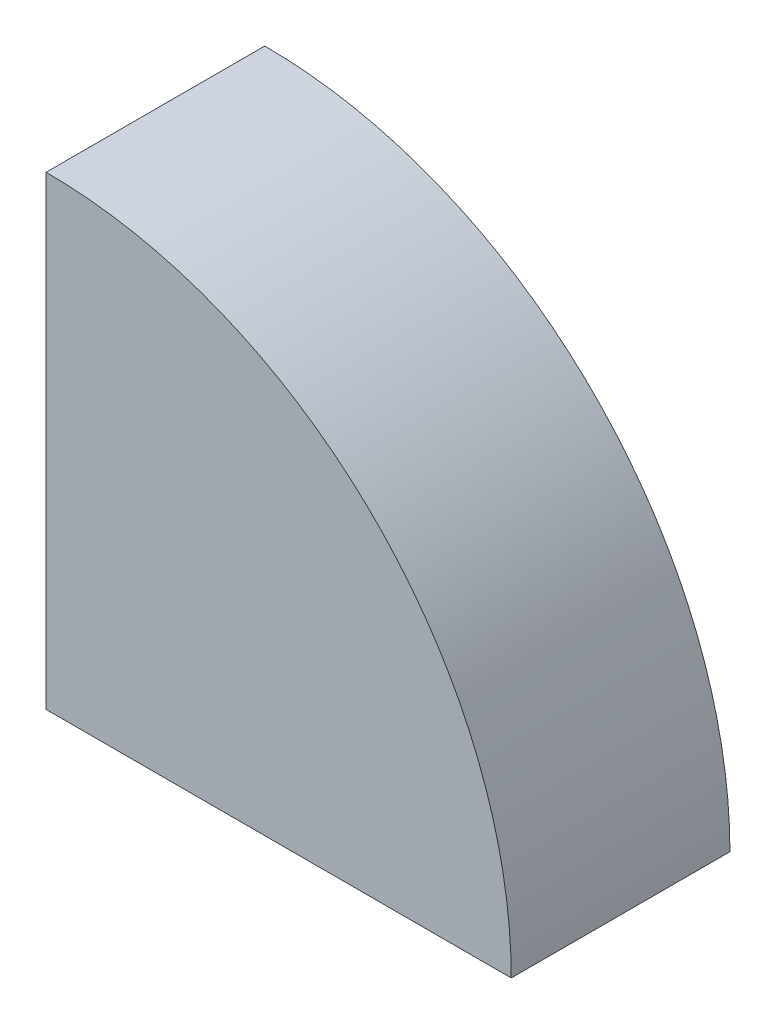
ISO-10303-21;
HEADER;
FILE_DESCRIPTION(('STEP AP214'),'2;1');
FILE_NAME('part.step','',(''),(''),'','','');
FILE_SCHEMA(('AUTOMOTIVE_DESIGN { 1 0 10303 214 1 1 1 1 }'));
ENDSEC;
DATA;
#1=APPLICATION_CONTEXT('core data for automotive mechanical design processes');
#2=APPLICATION_PROTOCOL_DEFINITION('international standard','automotive_design',2000,#1);
#3=PRODUCT_CONTEXT('',#1,'mechanical');
#4=PRODUCT('Part','Part','',(#3));
#5=PRODUCT_RELATED_PRODUCT_CATEGORY('part','',(#4));
#6=PRODUCT_DEFINITION_FORMATION('','',#4);
#7=PRODUCT_DEFINITION_CONTEXT('part definition',#1,'design');
#8=PRODUCT_DEFINITION('design','',#6,#7);
#9=PRODUCT_DEFINITION_SHAPE('','',#8);
#10=(LENGTH_UNIT() NAMED_UNIT(*) SI_UNIT(.MILLI.,.METRE.));
#11=(NAMED_UNIT(*) PLANE_ANGLE_UNIT() SI_UNIT($,.RADIAN.));
#12=(NAMED_UNIT(*) SI_UNIT($,.STERADIAN.) SOLID_ANGLE_UNIT());
#13=UNCERTAINTY_MEASURE_WITH_UNIT(LENGTH_MEASURE(1.E-05),#10,'distance_accuracy_value','');
#14=(GEOMETRIC_REPRESENTATION_CONTEXT(3) GLOBAL_UNCERTAINTY_ASSIGNED_CONTEXT((#13)) GLOBAL_UNIT_ASSIGNED_CONTEXT((#10,
#11,#12)) REPRESENTATION_CONTEXT('',''));
#15=CARTESIAN_POINT('',(0.,0.,0.));
#16=DIRECTION('',(0.,0.,1.));
#17=DIRECTION('',(1.,0.,0.));
#18=AXIS2_PLACEMENT_3D('',#15,#16,#17);
#19=CARTESIAN_POINT('',(2.,2.,164.030588258053));
#20=DIRECTION('',(0.,0.,-1.));
#21=DIRECTION('',(-1.,0.,0.));
#22=AXIS2_PLACEMENT_3D('',#19,#20,#21);
#23=CYLINDRICAL_SURFACE('',#22,85.);
#24=DIRECTION('',(0.,0.,-1.));
#25=VECTOR('',#24,1.);
#26=CARTESIAN_POINT('',(2.,87.,164.030588258053));
#27=LINE('',#26,#25);
#28=CARTESIAN_POINT('',(1.99999999999994,87.,33.));
#29=VERTEX_POINT('',#28);
#30=CARTESIAN_POINT('',(1.99999999999994,87.,9.4));
#31=VERTEX_POINT('',#30);
#32=EDGE_CURVE('E406',#29,#31,#27,.T.);
#33=ORIENTED_EDGE('',*,*,#32,.T.);
#34=CARTESIAN_POINT('',(2.,2.,9.39999999999999));
#35=DIRECTION('',(0.,0.,-1.));
#36=DIRECTION('',(-1.,0.,0.));
#37=AXIS2_PLACEMENT_3D('',#34,#35,#36);
#38=CIRCLE('',#37,85.);
#39=CARTESIAN_POINT('',(4.09999999999994,86.974054863823,9.4));
#40=VERTEX_POINT('',#39);
#41=EDGE_CURVE('E275',#31,#40,#38,.T.);
#42=ORIENTED_EDGE('',*,*,#41,.T.);
#43=DIRECTION('',(0.,0.,-1.));
#44=VECTOR('',#43,1.);
#45=CARTESIAN_POINT('',(4.09999999999994,86.974054863823,9.4));
#46=LINE('',#45,#44);
#47=CARTESIAN_POINT('',(4.09999999999994,86.974054863823,3.4));
#48=VERTEX_POINT('',#47);
#49=EDGE_CURVE('E258',#40,#48,#46,.T.);
#50=ORIENTED_EDGE('',*,*,#49,.T.);
#51=CARTESIAN_POINT('',(2.,2.,3.39999999999999));
#52=DIRECTION('',(0.,0.,-1.));
#53=DIRECTION('',(-1.,0.,0.));
#54=AXIS2_PLACEMENT_3D('',#51,#52,#53);
#55=CIRCLE('',#54,85.);
#56=CARTESIAN_POINT('',(1.99999999999994,87.,3.4));
#57=VERTEX_POINT('',#56);
#58=EDGE_CURVE('E269',#57,#48,#55,.T.);
#59=ORIENTED_EDGE('',*,*,#58,.F.);
#60=CARTESIAN_POINT('',(2.,87.,2.));
#61=VERTEX_POINT('',#60);
#62=EDGE_CURVE('E398',#57,#61,#27,.T.);
#63=ORIENTED_EDGE('',*,*,#62,.T.);
#64=CARTESIAN_POINT('',(2.,2.,2.));
#65=DIRECTION('',(0.,0.,1.));
#66=DIRECTION('',(1.,0.,0.));
#67=AXIS2_PLACEMENT_3D('',#64,#65,#66);
#68=CIRCLE('',#67,85.);
#69=CARTESIAN_POINT('',(87.,2.,2.));
#70=VERTEX_POINT('',#69);
#71=EDGE_CURVE('E383',#70,#61,#68,.T.);
#72=ORIENTED_EDGE('',*,*,#71,.F.);
#73=DIRECTION('',(0.,0.,-1.));
#74=VECTOR('',#73,1.);
#75=CARTESIAN_POINT('',(87.,2.,164.030588258053));
#76=LINE('',#75,#74);
#77=CARTESIAN_POINT('',(87.,2.,3.39999999999999));
#78=VERTEX_POINT('',#77);
#79=EDGE_CURVE('E402',#78,#70,#76,.T.);
#80=ORIENTED_EDGE('',*,*,#79,.F.);
#81=CARTESIAN_POINT('',(2.,2.,3.39999999999999));
#82=DIRECTION('',(0.,0.,-1.));
#83=DIRECTION('',(-1.,0.,0.));
#84=AXIS2_PLACEMENT_3D('',#81,#82,#83);
#85=CIRCLE('',#84,85.);
#86=CARTESIAN_POINT('',(86.974054863823,4.09999999999966,3.40000000000001));
#87=VERTEX_POINT('',#86);
#88=EDGE_CURVE('E334',#87,#78,#85,.T.);
#89=ORIENTED_EDGE('',*,*,#88,.F.);
#90=DIRECTION('',(0.,0.,-1.));
#91=VECTOR('',#90,1.);
#92=CARTESIAN_POINT('',(86.974054863823,4.1,9.4));
#93=LINE('',#92,#91);
#94=CARTESIAN_POINT('',(86.974054863823,4.10000000000001,9.39999999999999));
#95=VERTEX_POINT('',#94);
#96=EDGE_CURVE('E331',#95,#87,#93,.T.);
#97=ORIENTED_EDGE('',*,*,#96,.F.);
#98=CARTESIAN_POINT('',(2.,2.,9.39999999999999));
#99=DIRECTION('',(0.,0.,-1.));
#100=DIRECTION('',(-1.,0.,0.));
#101=AXIS2_PLACEMENT_3D('',#98,#99,#100);
#102=CIRCLE('',#101,85.);
#103=CARTESIAN_POINT('',(87.,2.,9.39999999999999));
#104=VERTEX_POINT('',#103);
#105=EDGE_CURVE('E341',#95,#104,#102,.T.);
#106=ORIENTED_EDGE('',*,*,#105,.T.);
#107=CARTESIAN_POINT('',(87.,2.,33.));
#108=VERTEX_POINT('',#107);
#109=EDGE_CURVE('E401',#108,#104,#76,.T.);
#110=ORIENTED_EDGE('',*,*,#109,.F.);
#111=CARTESIAN_POINT('',(2.,2.,33.));
#112=DIRECTION('',(0.,0.,1.));
#113=DIRECTION('',(1.,0.,0.));
#114=AXIS2_PLACEMENT_3D('',#111,#112,#113);
#115=CIRCLE('',#114,85.);
#116=CARTESIAN_POINT('',(86.974054863823,4.09999999999945,33.));
#117=VERTEX_POINT('',#116);
#118=EDGE_CURVE('E375',#108,#117,#115,.T.);
#119=ORIENTED_EDGE('',*,*,#118,.T.);
#120=DIRECTION('',(0.,0.,1.));
#121=VECTOR('',#120,1.);
#122=CARTESIAN_POINT('',(86.974054863823,4.1,33.));
#123=LINE('',#122,#121);
#124=CARTESIAN_POINT('',(86.974054863823,4.10000000000001,39.));
#125=VERTEX_POINT('',#124);
#126=EDGE_CURVE('E355',#117,#125,#123,.T.);
#127=ORIENTED_EDGE('',*,*,#126,.T.);
#128=CARTESIAN_POINT('',(2.,2.,39.));
#129=DIRECTION('',(0.,0.,1.));
#130=DIRECTION('',(1.,0.,0.));
#131=AXIS2_PLACEMENT_3D('',#128,#129,#130);
#132=CIRCLE('',#131,85.);
#133=CARTESIAN_POINT('',(87.,2.,39.));
#134=VERTEX_POINT('',#133);
#135=EDGE_CURVE('E369',#134,#125,#132,.T.);
#136=ORIENTED_EDGE('',*,*,#135,.F.);
#137=CARTESIAN_POINT('',(87.,2.,40.35));
#138=VERTEX_POINT('',#137);
#139=EDGE_CURVE('E387',#138,#134,#76,.T.);
#140=ORIENTED_EDGE('',*,*,#139,.F.);
#141=CARTESIAN_POINT('',(2.,2.,40.35));
#142=DIRECTION('',(0.,0.,1.));
#143=DIRECTION('',(1.,0.,0.));
#144=AXIS2_PLACEMENT_3D('',#141,#142,#143);
#145=CIRCLE('',#144,85.);
#146=CARTESIAN_POINT('',(2.,87.,40.35));
#147=VERTEX_POINT('',#146);
#148=EDGE_CURVE('E382',#138,#147,#145,.T.);
#149=ORIENTED_EDGE('',*,*,#148,.T.);
#150=CARTESIAN_POINT('',(2.,87.,39.));
#151=VERTEX_POINT('',#150);
#152=EDGE_CURVE('E403',#147,#151,#27,.T.);
#153=ORIENTED_EDGE('',*,*,#152,.T.);
#154=CARTESIAN_POINT('',(2.,2.,39.));
#155=DIRECTION('',(0.,0.,1.));
#156=DIRECTION('',(1.,0.,0.));
#157=AXIS2_PLACEMENT_3D('',#154,#155,#156);
#158=CIRCLE('',#157,85.);
#159=CARTESIAN_POINT('',(4.09999999999994,86.974054863823,39.));
#160=VERTEX_POINT('',#159);
#161=EDGE_CURVE('E299',#160,#151,#158,.T.);
#162=ORIENTED_EDGE('',*,*,#161,.F.);
#163=DIRECTION('',(0.,0.,1.));
#164=VECTOR('',#163,1.);
#165=CARTESIAN_POINT('',(4.09999999999994,86.974054863823,33.));
#166=LINE('',#165,#164);
#167=CARTESIAN_POINT('',(4.09999999999994,86.974054863823,33.));
#168=VERTEX_POINT('',#167);
#169=EDGE_CURVE('E297',#168,#160,#166,.T.);
#170=ORIENTED_EDGE('',*,*,#169,.F.);
#171=CARTESIAN_POINT('',(2.,2.,33.));
#172=DIRECTION('',(0.,0.,1.));
#173=DIRECTION('',(1.,0.,0.));
#174=AXIS2_PLACEMENT_3D('',#171,#172,#173);
#175=CIRCLE('',#174,85.);
#176=EDGE_CURVE('E306',#168,#29,#175,.T.);
#177=ORIENTED_EDGE('',*,*,#176,.T.);
#178=EDGE_LOOP('',(#33,#42,#50,#59,#63,#72,#80,#89,#97,#106,#110,#119,#127,#136,#140,#149,#153,
#162,#170,#177));
#179=FACE_BOUND('',#178,.T.);
#180=ADVANCED_FACE('F18',(#179),#23,.F.);
#181=CARTESIAN_POINT('',(0.,86.,42.4));
#182=DIRECTION('',(0.,1.,0.));
#183=DIRECTION('',(0.,0.,1.));
#184=AXIS2_PLACEMENT_3D('',#181,#182,#183);
#185=PLANE('',#184);
#186=DIRECTION('',(0.,0.,-1.));
#187=VECTOR('',#186,1.);
#188=CARTESIAN_POINT('',(2.,86.,164.030588258053));
#189=LINE('',#188,#187);
#190=CARTESIAN_POINT('',(1.99999999999999,86.,40.35));
#191=VERTEX_POINT('',#190);
#192=CARTESIAN_POINT('',(1.99999999999994,86.,39.));
#193=VERTEX_POINT('',#192);
#194=EDGE_CURVE('E399',#191,#193,#189,.T.);
#195=ORIENTED_EDGE('',*,*,#194,.F.);
#196=DIRECTION('',(-1.,0.,0.));
#197=VECTOR('',#196,1.);
#198=CARTESIAN_POINT('',(0.,86.,40.35));
#199=LINE('',#198,#197);
#200=CARTESIAN_POINT('',(0.,86.,40.35));
#201=VERTEX_POINT('',#200);
#202=EDGE_CURVE('E33',#191,#201,#199,.T.);
#203=ORIENTED_EDGE('',*,*,#202,.T.);
#204=DIRECTION('',(0.,0.,-1.));
#205=VECTOR('',#204,1.);
#206=CARTESIAN_POINT('',(0.,86.,42.4));
#207=LINE('',#206,#205);
#208=CARTESIAN_POINT('',(0.,86.,0.));
#209=VERTEX_POINT('',#208);
#210=EDGE_CURVE('E26',#201,#209,#207,.T.);
#211=ORIENTED_EDGE('',*,*,#210,.T.);
#212=DIRECTION('',(1.,0.,0.));
#213=VECTOR('',#212,1.);
#214=CARTESIAN_POINT('',(0.,86.,0.));
#215=LINE('',#214,#213);
#216=CARTESIAN_POINT('',(7.8,86.,0.));
#217=VERTEX_POINT('',#216);
#218=EDGE_CURVE('E432',#209,#217,#215,.T.);
#219=ORIENTED_EDGE('',*,*,#218,.T.);
#220=DIRECTION('',(0.,0.,-1.));
#221=VECTOR('',#220,1.);
#222=CARTESIAN_POINT('',(7.8,86.,42.4));
#223=LINE('',#222,#221);
#224=CARTESIAN_POINT('',(7.8,86.,2.));
#225=VERTEX_POINT('',#224);
#226=EDGE_CURVE('E446',#225,#217,#223,.T.);
#227=ORIENTED_EDGE('',*,*,#226,.F.);
#228=DIRECTION('',(1.,0.,0.));
#229=VECTOR('',#228,1.);
#230=CARTESIAN_POINT('',(0.,86.,2.));
#231=LINE('',#230,#229);
#232=CARTESIAN_POINT('',(2.,86.,2.));
#233=VERTEX_POINT('',#232);
#234=EDGE_CURVE('E417',#233,#225,#231,.T.);
#235=ORIENTED_EDGE('',*,*,#234,.F.);
#236=CARTESIAN_POINT('',(2.,86.,3.39999999999999));
#237=VERTEX_POINT('',#236);
#238=EDGE_CURVE('E381',#237,#233,#189,.T.);
#239=ORIENTED_EDGE('',*,*,#238,.F.);
#240=DIRECTION('',(1.,0.,0.));
#241=VECTOR('',#240,1.);
#242=CARTESIAN_POINT('',(1.99999999999994,86.,3.4));
#243=LINE('',#242,#241);
#244=CARTESIAN_POINT('',(0.299999999999942,86.,3.4));
#245=VERTEX_POINT('',#244);
#246=EDGE_CURVE('E231',#245,#237,#243,.T.);
#247=ORIENTED_EDGE('',*,*,#246,.F.);
#248=DIRECTION('',(0.,0.,-1.));
#249=VECTOR('',#248,1.);
#250=CARTESIAN_POINT('',(0.299999999999942,86.,9.4));
#251=LINE('',#250,#249);
#252=CARTESIAN_POINT('',(0.299999999999942,86.,9.4));
#253=VERTEX_POINT('',#252);
#254=EDGE_CURVE('E267',#253,#245,#251,.T.);
#255=ORIENTED_EDGE('',*,*,#254,.F.);
#256=DIRECTION('',(1.,0.,0.));
#257=VECTOR('',#256,1.);
#258=CARTESIAN_POINT('',(1.99999999999994,86.,9.4));
#259=LINE('',#258,#257);
#260=CARTESIAN_POINT('',(1.99999999999994,86.,9.4));
#261=VERTEX_POINT('',#260);
#262=EDGE_CURVE('E245',#253,#261,#259,.T.);
#263=ORIENTED_EDGE('',*,*,#262,.T.);
#264=CARTESIAN_POINT('',(1.99999999999994,86.,33.));
#265=VERTEX_POINT('',#264);
#266=EDGE_CURVE('E409',#265,#261,#189,.T.);
#267=ORIENTED_EDGE('',*,*,#266,.F.);
#268=DIRECTION('',(1.,0.,0.));
#269=VECTOR('',#268,1.);
#270=CARTESIAN_POINT('',(1.99999999999994,86.,33.));
#271=LINE('',#270,#269);
#272=CARTESIAN_POINT('',(0.299999999999942,86.,33.));
#273=VERTEX_POINT('',#272);
#274=EDGE_CURVE('E279',#273,#265,#271,.T.);
#275=ORIENTED_EDGE('',*,*,#274,.F.);
#276=DIRECTION('',(0.,0.,1.));
#277=VECTOR('',#276,1.);
#278=CARTESIAN_POINT('',(0.299999999999942,86.,33.));
#279=LINE('',#278,#277);
#280=CARTESIAN_POINT('',(0.299999999999942,86.,39.));
#281=VERTEX_POINT('',#280);
#282=EDGE_CURVE('E288',#273,#281,#279,.T.);
#283=ORIENTED_EDGE('',*,*,#282,.T.);
#284=DIRECTION('',(1.,0.,0.));
#285=VECTOR('',#284,1.);
#286=CARTESIAN_POINT('',(1.99999999999994,86.,39.));
#287=LINE('',#286,#285);
#288=EDGE_CURVE('E278',#281,#193,#287,.T.);
#289=ORIENTED_EDGE('',*,*,#288,.T.);
#290=EDGE_LOOP('',(#195,#203,#211,#219,#227,#235,#239,#247,#255,#263,#267,#275,#283,#289));
#291=FACE_BOUND('',#290,.T.);
#292=ADVANCED_FACE('F447',(#291),#185,.F.);
#293=CARTESIAN_POINT('',(2.,0.,164.030588258053));
#294=DIRECTION('',(-1.,0.,0.));
#295=DIRECTION('',(0.,0.,1.));
#296=AXIS2_PLACEMENT_3D('',#293,#294,#295);
#297=PLANE('',#296);
#298=DIRECTION('',(0.,1.,0.));
#299=VECTOR('',#298,1.);
#300=CARTESIAN_POINT('',(1.99999999999994,86.,9.4));
#301=LINE('',#300,#299);
#302=EDGE_CURVE('E248',#261,#31,#301,.T.);
#303=ORIENTED_EDGE('',*,*,#302,.T.);
#304=ORIENTED_EDGE('',*,*,#32,.F.);
#305=DIRECTION('',(0.,1.,0.));
#306=VECTOR('',#305,1.);
#307=CARTESIAN_POINT('',(1.99999999999994,86.,33.));
#308=LINE('',#307,#306);
#309=EDGE_CURVE('E286',#265,#29,#308,.T.);
#310=ORIENTED_EDGE('',*,*,#309,.F.);
#311=ORIENTED_EDGE('',*,*,#266,.T.);
#312=EDGE_LOOP('',(#303,#304,#310,#311));
#313=FACE_BOUND('',#312,.T.);
#314=ADVANCED_FACE('F477',(#313),#297,.F.);
#315=ORIENTED_EDGE('',*,*,#62,.F.);
#316=DIRECTION('',(0.,1.,0.));
#317=VECTOR('',#316,1.);
#318=CARTESIAN_POINT('',(1.99999999999994,86.,3.4));
#319=LINE('',#318,#317);
#320=EDGE_CURVE('E260',#237,#57,#319,.T.);
#321=ORIENTED_EDGE('',*,*,#320,.F.);
#322=ORIENTED_EDGE('',*,*,#238,.T.);
#323=DIRECTION('',(0.,1.,0.));
#324=VECTOR('',#323,1.);
#325=CARTESIAN_POINT('',(2.,0.,2.));
#326=LINE('',#325,#324);
#327=EDGE_CURVE('E378',#233,#61,#326,.T.);
#328=ORIENTED_EDGE('',*,*,#327,.T.);
#329=EDGE_LOOP('',(#315,#321,#322,#328));
#330=FACE_BOUND('',#329,.T.);
#331=ADVANCED_FACE('F471',(#330),#297,.F.);
#332=CARTESIAN_POINT('',(86.,0.,42.4));
#333=DIRECTION('',(1.,0.,0.));
#334=DIRECTION('',(0.,0.,-1.));
#335=AXIS2_PLACEMENT_3D('',#332,#333,#334);
#336=PLANE('',#335);
#337=DIRECTION('',(0.,0.,-1.));
#338=VECTOR('',#337,1.);
#339=CARTESIAN_POINT('',(86.,0.,42.4));
#340=LINE('',#339,#338);
#341=CARTESIAN_POINT('',(86.,0.,40.35));
#342=VERTEX_POINT('',#341);
#343=CARTESIAN_POINT('',(86.,0.,0.));
#344=VERTEX_POINT('',#343);
#345=EDGE_CURVE('E41',#342,#344,#340,.T.);
#346=ORIENTED_EDGE('',*,*,#345,.F.);
#347=DIRECTION('',(0.,1.,0.));
#348=VECTOR('',#347,1.);
#349=CARTESIAN_POINT('',(86.,7.8,40.35));
#350=LINE('',#349,#348);
#351=CARTESIAN_POINT('',(86.,2.,40.35));
#352=VERTEX_POINT('',#351);
#353=EDGE_CURVE('E241',#342,#352,#350,.T.);
#354=ORIENTED_EDGE('',*,*,#353,.T.);
#355=DIRECTION('',(0.,0.,-1.));
#356=VECTOR('',#355,1.);
#357=CARTESIAN_POINT('',(86.,2.,164.030588258053));
#358=LINE('',#357,#356);
#359=CARTESIAN_POINT('',(86.,2.,39.));
#360=VERTEX_POINT('',#359);
#361=EDGE_CURVE('E392',#352,#360,#358,.T.);
#362=ORIENTED_EDGE('',*,*,#361,.T.);
#363=DIRECTION('',(0.,1.,0.));
#364=VECTOR('',#363,1.);
#365=CARTESIAN_POINT('',(86.,2.,39.));
#366=LINE('',#365,#364);
#367=CARTESIAN_POINT('',(86.,0.299999999999999,39.));
#368=VERTEX_POINT('',#367);
#369=EDGE_CURVE('E343',#368,#360,#366,.T.);
#370=ORIENTED_EDGE('',*,*,#369,.F.);
#371=DIRECTION('',(0.,0.,1.));
#372=VECTOR('',#371,1.);
#373=CARTESIAN_POINT('',(86.,0.299999999999999,33.));
#374=LINE('',#373,#372);
#375=CARTESIAN_POINT('',(86.,0.299999999999999,33.));
#376=VERTEX_POINT('',#375);
#377=EDGE_CURVE('E366',#376,#368,#374,.T.);
#378=ORIENTED_EDGE('',*,*,#377,.F.);
#379=DIRECTION('',(0.,1.,0.));
#380=VECTOR('',#379,1.);
#381=CARTESIAN_POINT('',(86.,2.,33.));
#382=LINE('',#381,#380);
#383=CARTESIAN_POINT('',(86.,2.,33.));
#384=VERTEX_POINT('',#383);
#385=EDGE_CURVE('E344',#376,#384,#382,.T.);
#386=ORIENTED_EDGE('',*,*,#385,.T.);
#387=CARTESIAN_POINT('',(86.,2.,9.39999999999999));
#388=VERTEX_POINT('',#387);
#389=EDGE_CURVE('E412',#384,#388,#358,.T.);
#390=ORIENTED_EDGE('',*,*,#389,.T.);
#391=DIRECTION('',(0.,1.,0.));
#392=VECTOR('',#391,1.);
#393=CARTESIAN_POINT('',(86.,2.,9.4));
#394=LINE('',#393,#392);
#395=CARTESIAN_POINT('',(86.,0.299999999999999,9.4));
#396=VERTEX_POINT('',#395);
#397=EDGE_CURVE('E310',#396,#388,#394,.T.);
#398=ORIENTED_EDGE('',*,*,#397,.F.);
#399=DIRECTION('',(0.,0.,-1.));
#400=VECTOR('',#399,1.);
#401=CARTESIAN_POINT('',(86.,0.299999999999999,9.4));
#402=LINE('',#401,#400);
#403=CARTESIAN_POINT('',(86.,0.299999999999999,3.4));
#404=VERTEX_POINT('',#403);
#405=EDGE_CURVE('E322',#396,#404,#402,.T.);
#406=ORIENTED_EDGE('',*,*,#405,.T.);
#407=DIRECTION('',(0.,1.,0.));
#408=VECTOR('',#407,1.);
#409=CARTESIAN_POINT('',(86.,2.,3.4));
#410=LINE('',#409,#408);
#411=CARTESIAN_POINT('',(86.,2.,3.4));
#412=VERTEX_POINT('',#411);
#413=EDGE_CURVE('E309',#404,#412,#410,.T.);
#414=ORIENTED_EDGE('',*,*,#413,.T.);
#415=CARTESIAN_POINT('',(86.,2.,2.));
#416=VERTEX_POINT('',#415);
#417=EDGE_CURVE('E386',#412,#416,#358,.T.);
#418=ORIENTED_EDGE('',*,*,#417,.T.);
#419=DIRECTION('',(0.,-1.,0.));
#420=VECTOR('',#419,1.);
#421=CARTESIAN_POINT('',(86.,0.,2.));
#422=LINE('',#421,#420);
#423=CARTESIAN_POINT('',(86.,7.8,2.));
#424=VERTEX_POINT('',#423);
#425=EDGE_CURVE('E391',#424,#416,#422,.T.);
#426=ORIENTED_EDGE('',*,*,#425,.F.);
#427=DIRECTION('',(0.,0.,-1.));
#428=VECTOR('',#427,1.);
#429=CARTESIAN_POINT('',(86.,7.8,42.4));
#430=LINE('',#429,#428);
#431=CARTESIAN_POINT('',(86.,7.8,0.));
#432=VERTEX_POINT('',#431);
#433=EDGE_CURVE('E444',#424,#432,#430,.T.);
#434=ORIENTED_EDGE('',*,*,#433,.T.);
#435=DIRECTION('',(0.,-1.,0.));
#436=VECTOR('',#435,1.);
#437=CARTESIAN_POINT('',(86.,0.,0.));
#438=LINE('',#437,#436);
#439=EDGE_CURVE('E438',#432,#344,#438,.T.);
#440=ORIENTED_EDGE('',*,*,#439,.T.);
#441=EDGE_LOOP('',(#346,#354,#362,#370,#378,#386,#390,#398,#406,#414,#418,#426,#434,#440));
#442=FACE_BOUND('',#441,.T.);
#443=ADVANCED_FACE('F530',(#442),#336,.F.);
#444=CARTESIAN_POINT('',(0.,2.,164.030588258053));
#445=DIRECTION('',(0.,1.,0.));
#446=DIRECTION('',(0.,0.,1.));
#447=AXIS2_PLACEMENT_3D('',#444,#445,#446);
#448=PLANE('',#447);
#449=ORIENTED_EDGE('',*,*,#109,.T.);
#450=DIRECTION('',(1.,0.,0.));
#451=VECTOR('',#450,1.);
#452=CARTESIAN_POINT('',(86.,2.,9.4));
#453=LINE('',#452,#451);
#454=EDGE_CURVE('E319',#388,#104,#453,.T.);
#455=ORIENTED_EDGE('',*,*,#454,.F.);
#456=ORIENTED_EDGE('',*,*,#389,.F.);
#457=DIRECTION('',(1.,0.,0.));
#458=VECTOR('',#457,1.);
#459=CARTESIAN_POINT('',(86.,2.,33.));
#460=LINE('',#459,#458);
#461=EDGE_CURVE('E346',#384,#108,#460,.T.);
#462=ORIENTED_EDGE('',*,*,#461,.T.);
#463=EDGE_LOOP('',(#449,#455,#456,#462));
#464=FACE_BOUND('',#463,.T.);
#465=ADVANCED_FACE('F533',(#464),#448,.T.);
#466=DIRECTION('',(1.,0.,0.));
#467=VECTOR('',#466,1.);
#468=CARTESIAN_POINT('',(86.,2.,3.4));
#469=LINE('',#468,#467);
#470=EDGE_CURVE('E314',#412,#78,#469,.T.);
#471=ORIENTED_EDGE('',*,*,#470,.T.);
#472=ORIENTED_EDGE('',*,*,#79,.T.);
#473=DIRECTION('',(1.,0.,0.));
#474=VECTOR('',#473,1.);
#475=CARTESIAN_POINT('',(0.,2.,2.));
#476=LINE('',#475,#474);
#477=EDGE_CURVE('E388',#416,#70,#476,.T.);
#478=ORIENTED_EDGE('',*,*,#477,.F.);
#479=ORIENTED_EDGE('',*,*,#417,.F.);
#480=EDGE_LOOP('',(#471,#472,#478,#479));
#481=FACE_BOUND('',#480,.T.);
#482=ADVANCED_FACE('F535',(#481),#448,.T.);
#483=CARTESIAN_POINT('',(7.8,86.,42.4));
#484=DIRECTION('',(0.707106781186548,0.707106781186548,0.));
#485=DIRECTION('',(-0.707106781186548,0.707106781186548,0.));
#486=AXIS2_PLACEMENT_3D('',#483,#484,#485);
#487=PLANE('',#486);
#488=DIRECTION('',(0.707106781186548,-0.707106781186548,0.));
#489=VECTOR('',#488,1.);
#490=CARTESIAN_POINT('',(7.8,86.,2.));
#491=LINE('',#490,#489);
#492=EDGE_CURVE('E415',#225,#424,#491,.T.);
#493=ORIENTED_EDGE('',*,*,#492,.F.);
#494=ORIENTED_EDGE('',*,*,#226,.T.);
#495=DIRECTION('',(0.707106781186548,-0.707106781186548,0.));
#496=VECTOR('',#495,1.);
#497=CARTESIAN_POINT('',(7.8,86.,0.));
#498=LINE('',#497,#496);
#499=EDGE_CURVE('E435',#217,#432,#498,.T.);
#500=ORIENTED_EDGE('',*,*,#499,.T.);
#501=ORIENTED_EDGE('',*,*,#433,.F.);
#502=EDGE_LOOP('',(#493,#494,#500,#501));
#503=FACE_BOUND('',#502,.T.);
#504=ADVANCED_FACE('F460',(#503),#487,.F.);
#505=CARTESIAN_POINT('',(0.,0.,42.4));
#506=DIRECTION('',(0.,0.,-1.));
#507=DIRECTION('',(-1.,0.,0.));
#508=AXIS2_PLACEMENT_3D('',#505,#506,#507);
#509=CYLINDRICAL_SURFACE('',#508,90.2);
#510=CARTESIAN_POINT('',(0.,0.,0.));
#511=DIRECTION('',(0.,0.,1.));
#512=DIRECTION('',(1.,0.,0.));
#513=AXIS2_PLACEMENT_3D('',#510,#511,#512);
#514=CIRCLE('',#513,90.2);
#515=CARTESIAN_POINT('',(90.2,0.,0.));
#516=VERTEX_POINT('',#515);
#517=CARTESIAN_POINT('',(0.,90.2,0.));
#518=VERTEX_POINT('',#517);
#519=EDGE_CURVE('E419',#516,#518,#514,.T.);
#520=ORIENTED_EDGE('',*,*,#519,.T.);
#521=DIRECTION('',(0.,0.,-1.));
#522=VECTOR('',#521,1.);
#523=CARTESIAN_POINT('',(0.,90.2,42.4));
#524=LINE('',#523,#522);
#525=CARTESIAN_POINT('',(0.,90.2,42.4));
#526=VERTEX_POINT('',#525);
#527=EDGE_CURVE('E11',#526,#518,#524,.T.);
#528=ORIENTED_EDGE('',*,*,#527,.F.);
#529=CARTESIAN_POINT('',(0.,0.,42.4));
#530=DIRECTION('',(0.,0.,1.));
#531=DIRECTION('',(1.,0.,0.));
#532=AXIS2_PLACEMENT_3D('',#529,#530,#531);
#533=CIRCLE('',#532,90.2);
#534=CARTESIAN_POINT('',(90.2,0.,42.4));
#535=VERTEX_POINT('',#534);
#536=EDGE_CURVE('E420',#535,#526,#533,.T.);
#537=ORIENTED_EDGE('',*,*,#536,.F.);
#538=DIRECTION('',(0.,0.,-1.));
#539=VECTOR('',#538,1.);
#540=CARTESIAN_POINT('',(90.2,0.,42.4));
#541=LINE('',#540,#539);
#542=EDGE_CURVE('E427',#535,#516,#541,.T.);
#543=ORIENTED_EDGE('',*,*,#542,.T.);
#544=EDGE_LOOP('',(#520,#528,#537,#543));
#545=FACE_BOUND('',#544,.T.);
#546=ADVANCED_FACE('F20',(#545),#509,.T.);
#547=CARTESIAN_POINT('',(0.,90.2,42.4));
#548=DIRECTION('',(1.,0.,0.));
#549=DIRECTION('',(0.,1.,0.));
#550=AXIS2_PLACEMENT_3D('',#547,#548,#549);
#551=PLANE('',#550);
#552=DIRECTION('',(0.,-1.,0.));
#553=VECTOR('',#552,1.);
#554=CARTESIAN_POINT('',(0.,90.2,0.));
#555=LINE('',#554,#553);
#556=EDGE_CURVE('E430',#518,#209,#555,.T.);
#557=ORIENTED_EDGE('',*,*,#556,.T.);
#558=ORIENTED_EDGE('',*,*,#210,.F.);
#559=DIRECTION('',(0.,-1.,0.));
#560=VECTOR('',#559,1.);
#561=CARTESIAN_POINT('',(0.,0.,40.35));
#562=LINE('',#561,#560);
#563=CARTESIAN_POINT('',(0.,0.,40.35));
#564=VERTEX_POINT('',#563);
#565=EDGE_CURVE('E234',#201,#564,#562,.T.);
#566=ORIENTED_EDGE('',*,*,#565,.T.);
#567=DIRECTION('',(0.,0.,1.));
#568=VECTOR('',#567,1.);
#569=CARTESIAN_POINT('',(0.,0.,40.35));
#570=LINE('',#569,#568);
#571=CARTESIAN_POINT('',(0.,0.,42.4));
#572=VERTEX_POINT('',#571);
#573=EDGE_CURVE('E222',#564,#572,#570,.T.);
#574=ORIENTED_EDGE('',*,*,#573,.T.);
#575=DIRECTION('',(0.,-1.,0.));
#576=VECTOR('',#575,1.);
#577=CARTESIAN_POINT('',(0.,90.2,42.4));
#578=LINE('',#577,#576);
#579=EDGE_CURVE('E423',#526,#572,#578,.T.);
#580=ORIENTED_EDGE('',*,*,#579,.F.);
#581=ORIENTED_EDGE('',*,*,#527,.T.);
#582=EDGE_LOOP('',(#557,#558,#566,#574,#580,#581));
#583=FACE_BOUND('',#582,.T.);
#584=ADVANCED_FACE('F236',(#583),#551,.F.);
#585=CARTESIAN_POINT('',(90.2,0.,42.4));
#586=DIRECTION('',(0.,1.,0.));
#587=DIRECTION('',(-1.,0.,0.));
#588=AXIS2_PLACEMENT_3D('',#585,#586,#587);
#589=PLANE('',#588);
#590=DIRECTION('',(1.,0.,0.));
#591=VECTOR('',#590,1.);
#592=CARTESIAN_POINT('',(90.2,0.,0.));
#593=LINE('',#592,#591);
#594=EDGE_CURVE('E424',#344,#516,#593,.T.);
#595=ORIENTED_EDGE('',*,*,#594,.T.);
#596=ORIENTED_EDGE('',*,*,#542,.F.);
#597=DIRECTION('',(1.,0.,0.));
#598=VECTOR('',#597,1.);
#599=CARTESIAN_POINT('',(90.2,0.,42.4));
#600=LINE('',#599,#598);
#601=EDGE_CURVE('E228',#572,#535,#600,.T.);
#602=ORIENTED_EDGE('',*,*,#601,.F.);
#603=ORIENTED_EDGE('',*,*,#573,.F.);
#604=DIRECTION('',(1.,0.,0.));
#605=VECTOR('',#604,1.);
#606=CARTESIAN_POINT('',(86.,0.,40.35));
#607=LINE('',#606,#605);
#608=EDGE_CURVE('E226',#564,#342,#607,.T.);
#609=ORIENTED_EDGE('',*,*,#608,.T.);
#610=ORIENTED_EDGE('',*,*,#345,.T.);
#611=EDGE_LOOP('',(#595,#596,#602,#603,#609,#610));
#612=FACE_BOUND('',#611,.T.);
#613=ADVANCED_FACE('F224',(#612),#589,.F.);
#614=CARTESIAN_POINT('',(0.,0.,42.4));
#615=DIRECTION('',(0.,0.,1.));
#616=DIRECTION('',(1.,0.,0.));
#617=AXIS2_PLACEMENT_3D('',#614,#615,#616);
#618=PLANE('',#617);
#619=ORIENTED_EDGE('',*,*,#579,.T.);
#620=ORIENTED_EDGE('',*,*,#601,.T.);
#621=ORIENTED_EDGE('',*,*,#536,.T.);
#622=EDGE_LOOP('',(#619,#620,#621));
#623=FACE_BOUND('',#622,.T.);
#624=ADVANCED_FACE('F522',(#623),#618,.T.);
#625=CARTESIAN_POINT('',(0.,0.,0.));
#626=DIRECTION('',(0.,0.,1.));
#627=DIRECTION('',(1.,0.,0.));
#628=AXIS2_PLACEMENT_3D('',#625,#626,#627);
#629=PLANE('',#628);
#630=ORIENTED_EDGE('',*,*,#519,.F.);
#631=ORIENTED_EDGE('',*,*,#594,.F.);
#632=ORIENTED_EDGE('',*,*,#439,.F.);
#633=ORIENTED_EDGE('',*,*,#499,.F.);
#634=ORIENTED_EDGE('',*,*,#218,.F.);
#635=ORIENTED_EDGE('',*,*,#556,.F.);
#636=EDGE_LOOP('',(#630,#631,#632,#633,#634,#635));
#637=FACE_BOUND('',#636,.T.);
#638=ADVANCED_FACE('F454',(#637),#629,.F.);
#639=CARTESIAN_POINT('',(0.,0.,40.35));
#640=DIRECTION('',(0.,0.,1.));
#641=DIRECTION('',(1.,0.,0.));
#642=AXIS2_PLACEMENT_3D('',#639,#640,#641);
#643=PLANE('',#642);
#644=DIRECTION('',(1.,0.,0.));
#645=VECTOR('',#644,1.);
#646=CARTESIAN_POINT('',(0.,2.,40.35));
#647=LINE('',#646,#645);
#648=EDGE_CURVE('E377',#352,#138,#647,.T.);
#649=ORIENTED_EDGE('',*,*,#648,.F.);
#650=ORIENTED_EDGE('',*,*,#353,.F.);
#651=ORIENTED_EDGE('',*,*,#608,.F.);
#652=ORIENTED_EDGE('',*,*,#565,.F.);
#653=ORIENTED_EDGE('',*,*,#202,.F.);
#654=DIRECTION('',(0.,1.,0.));
#655=VECTOR('',#654,1.);
#656=CARTESIAN_POINT('',(2.,0.,40.35));
#657=LINE('',#656,#655);
#658=EDGE_CURVE('E395',#191,#147,#657,.T.);
#659=ORIENTED_EDGE('',*,*,#658,.T.);
#660=ORIENTED_EDGE('',*,*,#148,.F.);
#661=EDGE_LOOP('',(#649,#650,#651,#652,#653,#659,#660));
#662=FACE_BOUND('',#661,.T.);
#663=ADVANCED_FACE('F240',(#662),#643,.F.);
#664=CARTESIAN_POINT('',(0.,0.,2.));
#665=DIRECTION('',(0.,0.,1.));
#666=DIRECTION('',(1.,0.,0.));
#667=AXIS2_PLACEMENT_3D('',#664,#665,#666);
#668=PLANE('',#667);
#669=ORIENTED_EDGE('',*,*,#234,.T.);
#670=ORIENTED_EDGE('',*,*,#492,.T.);
#671=ORIENTED_EDGE('',*,*,#425,.T.);
#672=ORIENTED_EDGE('',*,*,#477,.T.);
#673=ORIENTED_EDGE('',*,*,#71,.T.);
#674=ORIENTED_EDGE('',*,*,#327,.F.);
#675=EDGE_LOOP('',(#669,#670,#671,#672,#673,#674));
#676=FACE_BOUND('',#675,.T.);
#677=ADVANCED_FACE('F466',(#676),#668,.T.);
#678=ORIENTED_EDGE('',*,*,#194,.T.);
#679=DIRECTION('',(0.,1.,0.));
#680=VECTOR('',#679,1.);
#681=CARTESIAN_POINT('',(1.99999999999994,86.,39.));
#682=LINE('',#681,#680);
#683=EDGE_CURVE('E282',#193,#151,#682,.T.);
#684=ORIENTED_EDGE('',*,*,#683,.T.);
#685=ORIENTED_EDGE('',*,*,#152,.F.);
#686=ORIENTED_EDGE('',*,*,#658,.F.);
#687=EDGE_LOOP('',(#678,#684,#685,#686));
#688=FACE_BOUND('',#687,.T.);
#689=ADVANCED_FACE('F516',(#688),#297,.F.);
#690=DIRECTION('',(1.,0.,0.));
#691=VECTOR('',#690,1.);
#692=CARTESIAN_POINT('',(86.,2.,39.));
#693=LINE('',#692,#691);
#694=EDGE_CURVE('E358',#360,#134,#693,.T.);
#695=ORIENTED_EDGE('',*,*,#694,.F.);
#696=ORIENTED_EDGE('',*,*,#361,.F.);
#697=ORIENTED_EDGE('',*,*,#648,.T.);
#698=ORIENTED_EDGE('',*,*,#139,.T.);
#699=EDGE_LOOP('',(#695,#696,#697,#698));
#700=FACE_BOUND('',#699,.T.);
#701=ADVANCED_FACE('F514',(#700),#448,.T.);
#702=CARTESIAN_POINT('',(86.,0.299999999999999,33.));
#703=DIRECTION('',(0.,-1.,0.));
#704=DIRECTION('',(1.,0.,0.));
#705=AXIS2_PLACEMENT_3D('',#702,#703,#704);
#706=PLANE('',#705);
#707=DIRECTION('',(1.,0.,0.));
#708=VECTOR('',#707,1.);
#709=CARTESIAN_POINT('',(86.,0.299999999999999,39.));
#710=LINE('',#709,#708);
#711=CARTESIAN_POINT('',(81.25,0.299999999999999,39.));
#712=VERTEX_POINT('',#711);
#713=EDGE_CURVE('E347',#712,#368,#710,.T.);
#714=ORIENTED_EDGE('',*,*,#713,.F.);
#715=DIRECTION('',(0.,0.,1.));
#716=VECTOR('',#715,1.);
#717=CARTESIAN_POINT('',(81.25,0.299999999999999,33.));
#718=LINE('',#717,#716);
#719=CARTESIAN_POINT('',(81.25,0.299999999999999,33.));
#720=VERTEX_POINT('',#719);
#721=EDGE_CURVE('E370',#720,#712,#718,.T.);
#722=ORIENTED_EDGE('',*,*,#721,.F.);
#723=DIRECTION('',(1.,0.,0.));
#724=VECTOR('',#723,1.);
#725=CARTESIAN_POINT('',(86.,0.299999999999999,33.));
#726=LINE('',#725,#724);
#727=EDGE_CURVE('E352',#720,#376,#726,.T.);
#728=ORIENTED_EDGE('',*,*,#727,.T.);
#729=ORIENTED_EDGE('',*,*,#377,.T.);
#730=EDGE_LOOP('',(#714,#722,#728,#729));
#731=FACE_BOUND('',#730,.T.);
#732=ADVANCED_FACE('F574',(#731),#706,.T.);
#733=CARTESIAN_POINT('',(81.25,0.299999999999999,33.));
#734=DIRECTION('',(-0.553083238164048,0.83312599987155,0.));
#735=DIRECTION('',(-0.83312599987155,-0.553083238164048,0.));
#736=AXIS2_PLACEMENT_3D('',#733,#734,#735);
#737=PLANE('',#736);
#738=DIRECTION('',(-0.83312599987155,-0.553083238164048,0.));
#739=VECTOR('',#738,1.);
#740=CARTESIAN_POINT('',(81.25,0.299999999999999,39.));
#741=LINE('',#740,#739);
#742=EDGE_CURVE('E361',#125,#712,#741,.T.);
#743=ORIENTED_EDGE('',*,*,#742,.F.);
#744=ORIENTED_EDGE('',*,*,#126,.F.);
#745=DIRECTION('',(-0.83312599987155,-0.553083238164048,0.));
#746=VECTOR('',#745,1.);
#747=CARTESIAN_POINT('',(81.25,0.299999999999999,33.));
#748=LINE('',#747,#746);
#749=EDGE_CURVE('E349',#117,#720,#748,.T.);
#750=ORIENTED_EDGE('',*,*,#749,.T.);
#751=ORIENTED_EDGE('',*,*,#721,.T.);
#752=EDGE_LOOP('',(#743,#744,#750,#751));
#753=FACE_BOUND('',#752,.T.);
#754=ADVANCED_FACE('F569',(#753),#737,.T.);
#755=CARTESIAN_POINT('',(61.210373051325,2.73153390090851,33.));
#756=DIRECTION('',(0.,0.,1.));
#757=DIRECTION('',(1.,0.,0.));
#758=AXIS2_PLACEMENT_3D('',#755,#756,#757);
#759=PLANE('',#758);
#760=ORIENTED_EDGE('',*,*,#118,.F.);
#761=ORIENTED_EDGE('',*,*,#461,.F.);
#762=ORIENTED_EDGE('',*,*,#385,.F.);
#763=ORIENTED_EDGE('',*,*,#727,.F.);
#764=ORIENTED_EDGE('',*,*,#749,.F.);
#765=EDGE_LOOP('',(#760,#761,#762,#763,#764));
#766=FACE_BOUND('',#765,.T.);
#767=ADVANCED_FACE('F562',(#766),#759,.F.);
#768=CARTESIAN_POINT('',(61.210373051325,2.73153390090851,39.));
#769=DIRECTION('',(0.,0.,1.));
#770=DIRECTION('',(1.,0.,0.));
#771=AXIS2_PLACEMENT_3D('',#768,#769,#770);
#772=PLANE('',#771);
#773=ORIENTED_EDGE('',*,*,#694,.T.);
#774=ORIENTED_EDGE('',*,*,#135,.T.);
#775=ORIENTED_EDGE('',*,*,#742,.T.);
#776=ORIENTED_EDGE('',*,*,#713,.T.);
#777=ORIENTED_EDGE('',*,*,#369,.T.);
#778=EDGE_LOOP('',(#773,#774,#775,#776,#777));
#779=FACE_BOUND('',#778,.T.);
#780=ADVANCED_FACE('F572',(#779),#772,.T.);
#781=CARTESIAN_POINT('',(81.25,0.299999999999999,9.4));
#782=DIRECTION('',(0.553083238164048,-0.83312599987155,0.));
#783=DIRECTION('',(0.83312599987155,0.553083238164048,0.));
#784=AXIS2_PLACEMENT_3D('',#781,#782,#783);
#785=PLANE('',#784);
#786=DIRECTION('',(-0.83312599987155,-0.553083238164048,0.));
#787=VECTOR('',#786,1.);
#788=CARTESIAN_POINT('',(81.25,0.299999999999999,3.4));
#789=LINE('',#788,#787);
#790=CARTESIAN_POINT('',(81.25,0.299999999999999,3.4));
#791=VERTEX_POINT('',#790);
#792=EDGE_CURVE('E328',#87,#791,#789,.T.);
#793=ORIENTED_EDGE('',*,*,#792,.T.);
#794=DIRECTION('',(0.,0.,-1.));
#795=VECTOR('',#794,1.);
#796=CARTESIAN_POINT('',(81.25,0.299999999999999,9.4));
#797=LINE('',#796,#795);
#798=CARTESIAN_POINT('',(81.25,0.299999999999999,9.4));
#799=VERTEX_POINT('',#798);
#800=EDGE_CURVE('E335',#799,#791,#797,.T.);
#801=ORIENTED_EDGE('',*,*,#800,.F.);
#802=DIRECTION('',(-0.83312599987155,-0.553083238164048,0.));
#803=VECTOR('',#802,1.);
#804=CARTESIAN_POINT('',(81.25,0.299999999999999,9.4));
#805=LINE('',#804,#803);
#806=EDGE_CURVE('E317',#95,#799,#805,.T.);
#807=ORIENTED_EDGE('',*,*,#806,.F.);
#808=ORIENTED_EDGE('',*,*,#96,.T.);
#809=EDGE_LOOP('',(#793,#801,#807,#808));
#810=FACE_BOUND('',#809,.T.);
#811=ADVANCED_FACE('F613',(#810),#785,.F.);
#812=CARTESIAN_POINT('',(86.,0.299999999999999,9.4));
#813=DIRECTION('',(0.,1.,0.));
#814=DIRECTION('',(-1.,0.,0.));
#815=AXIS2_PLACEMENT_3D('',#812,#813,#814);
#816=PLANE('',#815);
#817=DIRECTION('',(1.,0.,0.));
#818=VECTOR('',#817,1.);
#819=CARTESIAN_POINT('',(86.,0.299999999999999,3.4));
#820=LINE('',#819,#818);
#821=EDGE_CURVE('E325',#791,#404,#820,.T.);
#822=ORIENTED_EDGE('',*,*,#821,.T.);
#823=ORIENTED_EDGE('',*,*,#405,.F.);
#824=DIRECTION('',(1.,0.,0.));
#825=VECTOR('',#824,1.);
#826=CARTESIAN_POINT('',(86.,0.299999999999999,9.4));
#827=LINE('',#826,#825);
#828=EDGE_CURVE('E313',#799,#396,#827,.T.);
#829=ORIENTED_EDGE('',*,*,#828,.F.);
#830=ORIENTED_EDGE('',*,*,#800,.T.);
#831=EDGE_LOOP('',(#822,#823,#829,#830));
#832=FACE_BOUND('',#831,.T.);
#833=ADVANCED_FACE('F609',(#832),#816,.F.);
#834=CARTESIAN_POINT('',(61.210373051325,2.73153390090851,9.4));
#835=DIRECTION('',(0.,0.,-1.));
#836=DIRECTION('',(1.,0.,0.));
#837=AXIS2_PLACEMENT_3D('',#834,#835,#836);
#838=PLANE('',#837);
#839=ORIENTED_EDGE('',*,*,#105,.F.);
#840=ORIENTED_EDGE('',*,*,#806,.T.);
#841=ORIENTED_EDGE('',*,*,#828,.T.);
#842=ORIENTED_EDGE('',*,*,#397,.T.);
#843=ORIENTED_EDGE('',*,*,#454,.T.);
#844=EDGE_LOOP('',(#839,#840,#841,#842,#843));
#845=FACE_BOUND('',#844,.T.);
#846=ADVANCED_FACE('F556',(#845),#838,.F.);
#847=CARTESIAN_POINT('',(61.210373051325,2.73153390090851,3.4));
#848=DIRECTION('',(0.,0.,-1.));
#849=DIRECTION('',(1.,0.,0.));
#850=AXIS2_PLACEMENT_3D('',#847,#848,#849);
#851=PLANE('',#850);
#852=ORIENTED_EDGE('',*,*,#792,.F.);
#853=ORIENTED_EDGE('',*,*,#88,.T.);
#854=ORIENTED_EDGE('',*,*,#470,.F.);
#855=ORIENTED_EDGE('',*,*,#413,.F.);
#856=ORIENTED_EDGE('',*,*,#821,.F.);
#857=EDGE_LOOP('',(#852,#853,#854,#855,#856));
#858=FACE_BOUND('',#857,.T.);
#859=ADVANCED_FACE('F603',(#858),#851,.T.);
#860=CARTESIAN_POINT('',(0.299999999999945,81.25,33.));
#861=DIRECTION('',(-0.833125999871551,0.553083238164048,0.));
#862=DIRECTION('',(-0.553083238164048,-0.833125999871551,0.));
#863=AXIS2_PLACEMENT_3D('',#860,#861,#862);
#864=PLANE('',#863);
#865=DIRECTION('',(-0.553083238164048,-0.83312599987155,0.));
#866=VECTOR('',#865,1.);
#867=CARTESIAN_POINT('',(0.299999999999945,81.25,39.));
#868=LINE('',#867,#866);
#869=CARTESIAN_POINT('',(0.299999999999945,81.25,39.));
#870=VERTEX_POINT('',#869);
#871=EDGE_CURVE('E293',#160,#870,#868,.T.);
#872=ORIENTED_EDGE('',*,*,#871,.T.);
#873=DIRECTION('',(0.,0.,1.));
#874=VECTOR('',#873,1.);
#875=CARTESIAN_POINT('',(0.299999999999945,81.25,33.));
#876=LINE('',#875,#874);
#877=CARTESIAN_POINT('',(0.299999999999945,81.25,33.));
#878=VERTEX_POINT('',#877);
#879=EDGE_CURVE('E300',#878,#870,#876,.T.);
#880=ORIENTED_EDGE('',*,*,#879,.F.);
#881=DIRECTION('',(-0.553083238164048,-0.83312599987155,0.));
#882=VECTOR('',#881,1.);
#883=CARTESIAN_POINT('',(0.299999999999945,81.25,33.));
#884=LINE('',#883,#882);
#885=EDGE_CURVE('E284',#168,#878,#884,.T.);
#886=ORIENTED_EDGE('',*,*,#885,.F.);
#887=ORIENTED_EDGE('',*,*,#169,.T.);
#888=EDGE_LOOP('',(#872,#880,#886,#887));
#889=FACE_BOUND('',#888,.T.);
#890=ADVANCED_FACE('F589',(#889),#864,.F.);
#891=CARTESIAN_POINT('',(0.299999999999942,86.,33.));
#892=DIRECTION('',(1.,0.,0.));
#893=DIRECTION('',(0.,1.,0.));
#894=AXIS2_PLACEMENT_3D('',#891,#892,#893);
#895=PLANE('',#894);
#896=DIRECTION('',(0.,1.,0.));
#897=VECTOR('',#896,1.);
#898=CARTESIAN_POINT('',(0.299999999999942,86.,39.));
#899=LINE('',#898,#897);
#900=EDGE_CURVE('E291',#870,#281,#899,.T.);
#901=ORIENTED_EDGE('',*,*,#900,.T.);
#902=ORIENTED_EDGE('',*,*,#282,.F.);
#903=DIRECTION('',(0.,1.,0.));
#904=VECTOR('',#903,1.);
#905=CARTESIAN_POINT('',(0.299999999999942,86.,33.));
#906=LINE('',#905,#904);
#907=EDGE_CURVE('E281',#878,#273,#906,.T.);
#908=ORIENTED_EDGE('',*,*,#907,.F.);
#909=ORIENTED_EDGE('',*,*,#879,.T.);
#910=EDGE_LOOP('',(#901,#902,#908,#909));
#911=FACE_BOUND('',#910,.T.);
#912=ADVANCED_FACE('F595',(#911),#895,.F.);
#913=CARTESIAN_POINT('',(2.73153390090847,61.210373051325,33.));
#914=DIRECTION('',(0.,0.,1.));
#915=DIRECTION('',(0.,1.,0.));
#916=AXIS2_PLACEMENT_3D('',#913,#914,#915);
#917=PLANE('',#916);
#918=ORIENTED_EDGE('',*,*,#176,.F.);
#919=ORIENTED_EDGE('',*,*,#885,.T.);
#920=ORIENTED_EDGE('',*,*,#907,.T.);
#921=ORIENTED_EDGE('',*,*,#274,.T.);
#922=ORIENTED_EDGE('',*,*,#309,.T.);
#923=EDGE_LOOP('',(#918,#919,#920,#921,#922));
#924=FACE_BOUND('',#923,.T.);
#925=ADVANCED_FACE('F593',(#924),#917,.F.);
#926=CARTESIAN_POINT('',(2.73153390090847,61.210373051325,39.));
#927=DIRECTION('',(0.,0.,1.));
#928=DIRECTION('',(0.,1.,0.));
#929=AXIS2_PLACEMENT_3D('',#926,#927,#928);
#930=PLANE('',#929);
#931=ORIENTED_EDGE('',*,*,#871,.F.);
#932=ORIENTED_EDGE('',*,*,#161,.T.);
#933=ORIENTED_EDGE('',*,*,#683,.F.);
#934=ORIENTED_EDGE('',*,*,#288,.F.);
#935=ORIENTED_EDGE('',*,*,#900,.F.);
#936=EDGE_LOOP('',(#931,#932,#933,#934,#935));
#937=FACE_BOUND('',#936,.T.);
#938=ADVANCED_FACE('F585',(#937),#930,.T.);
#939=CARTESIAN_POINT('',(0.299999999999942,86.,9.4));
#940=DIRECTION('',(-1.,0.,0.));
#941=DIRECTION('',(0.,-1.,0.));
#942=AXIS2_PLACEMENT_3D('',#939,#940,#941);
#943=PLANE('',#942);
#944=DIRECTION('',(0.,1.,0.));
#945=VECTOR('',#944,1.);
#946=CARTESIAN_POINT('',(0.299999999999942,86.,3.4));
#947=LINE('',#946,#945);
#948=CARTESIAN_POINT('',(0.299999999999945,81.25,3.4));
#949=VERTEX_POINT('',#948);
#950=EDGE_CURVE('E249',#949,#245,#947,.T.);
#951=ORIENTED_EDGE('',*,*,#950,.F.);
#952=DIRECTION('',(0.,0.,-1.));
#953=VECTOR('',#952,1.);
#954=CARTESIAN_POINT('',(0.299999999999945,81.25,9.4));
#955=LINE('',#954,#953);
#956=CARTESIAN_POINT('',(0.299999999999945,81.25,9.4));
#957=VERTEX_POINT('',#956);
#958=EDGE_CURVE('E270',#957,#949,#955,.T.);
#959=ORIENTED_EDGE('',*,*,#958,.F.);
#960=DIRECTION('',(0.,1.,0.));
#961=VECTOR('',#960,1.);
#962=CARTESIAN_POINT('',(0.299999999999942,86.,9.4));
#963=LINE('',#962,#961);
#964=EDGE_CURVE('E255',#957,#253,#963,.T.);
#965=ORIENTED_EDGE('',*,*,#964,.T.);
#966=ORIENTED_EDGE('',*,*,#254,.T.);
#967=EDGE_LOOP('',(#951,#959,#965,#966));
#968=FACE_BOUND('',#967,.T.);
#969=ADVANCED_FACE('F488',(#968),#943,.T.);
#970=CARTESIAN_POINT('',(0.299999999999945,81.25,9.4));
#971=DIRECTION('',(0.833125999871551,-0.553083238164048,0.));
#972=DIRECTION('',(0.553083238164048,0.833125999871551,0.));
#973=AXIS2_PLACEMENT_3D('',#970,#971,#972);
#974=PLANE('',#973);
#975=DIRECTION('',(-0.553083238164048,-0.83312599987155,0.));
#976=VECTOR('',#975,1.);
#977=CARTESIAN_POINT('',(0.299999999999945,81.25,3.4));
#978=LINE('',#977,#976);
#979=EDGE_CURVE('E262',#48,#949,#978,.T.);
#980=ORIENTED_EDGE('',*,*,#979,.F.);
#981=ORIENTED_EDGE('',*,*,#49,.F.);
#982=DIRECTION('',(-0.553083238164048,-0.83312599987155,0.));
#983=VECTOR('',#982,1.);
#984=CARTESIAN_POINT('',(0.299999999999945,81.25,9.4));
#985=LINE('',#984,#983);
#986=EDGE_CURVE('E252',#40,#957,#985,.T.);
#987=ORIENTED_EDGE('',*,*,#986,.T.);
#988=ORIENTED_EDGE('',*,*,#958,.T.);
#989=EDGE_LOOP('',(#980,#981,#987,#988));
#990=FACE_BOUND('',#989,.T.);
#991=ADVANCED_FACE('F491',(#990),#974,.T.);
#992=CARTESIAN_POINT('',(2.73153390090847,61.210373051325,9.4));
#993=DIRECTION('',(0.,0.,-1.));
#994=DIRECTION('',(0.,1.,0.));
#995=AXIS2_PLACEMENT_3D('',#992,#993,#994);
#996=PLANE('',#995);
#997=ORIENTED_EDGE('',*,*,#41,.F.);
#998=ORIENTED_EDGE('',*,*,#302,.F.);
#999=ORIENTED_EDGE('',*,*,#262,.F.);
#1000=ORIENTED_EDGE('',*,*,#964,.F.);
#1001=ORIENTED_EDGE('',*,*,#986,.F.);
#1002=EDGE_LOOP('',(#997,#998,#999,#1000,#1001));
#1003=FACE_BOUND('',#1002,.T.);
#1004=ADVANCED_FACE('F484',(#1003),#996,.F.);
#1005=CARTESIAN_POINT('',(2.73153390090847,61.210373051325,3.4));
#1006=DIRECTION('',(0.,0.,-1.));
#1007=DIRECTION('',(0.,1.,0.));
#1008=AXIS2_PLACEMENT_3D('',#1005,#1006,#1007);
#1009=PLANE('',#1008);
#1010=ORIENTED_EDGE('',*,*,#320,.T.);
#1011=ORIENTED_EDGE('',*,*,#58,.T.);
#1012=ORIENTED_EDGE('',*,*,#979,.T.);
#1013=ORIENTED_EDGE('',*,*,#950,.T.);
#1014=ORIENTED_EDGE('',*,*,#246,.T.);
#1015=EDGE_LOOP('',(#1010,#1011,#1012,#1013,#1014));
#1016=FACE_BOUND('',#1015,.T.);
#1017=ADVANCED_FACE('F497',(#1016),#1009,.T.);
#1018=CLOSED_SHELL('',(#180,#292,#314,#331,#443,#465,#482,#504,#546,#584,#613,#624,#638,#663,
#677,#689,#701,#732,#754,#767,#780,#811,#833,#846,#859,#890,#912,#925,#938,#969,#991,#1004,#1017));
#1019=MANIFOLD_SOLID_BREP('B1',#1018);
#1020=ADVANCED_BREP_SHAPE_REPRESENTATION('',(#18,#1019),#14);
#1021=SHAPE_DEFINITION_REPRESENTATION(#9,#1020);
ENDSEC;
END-ISO-10303-21;
